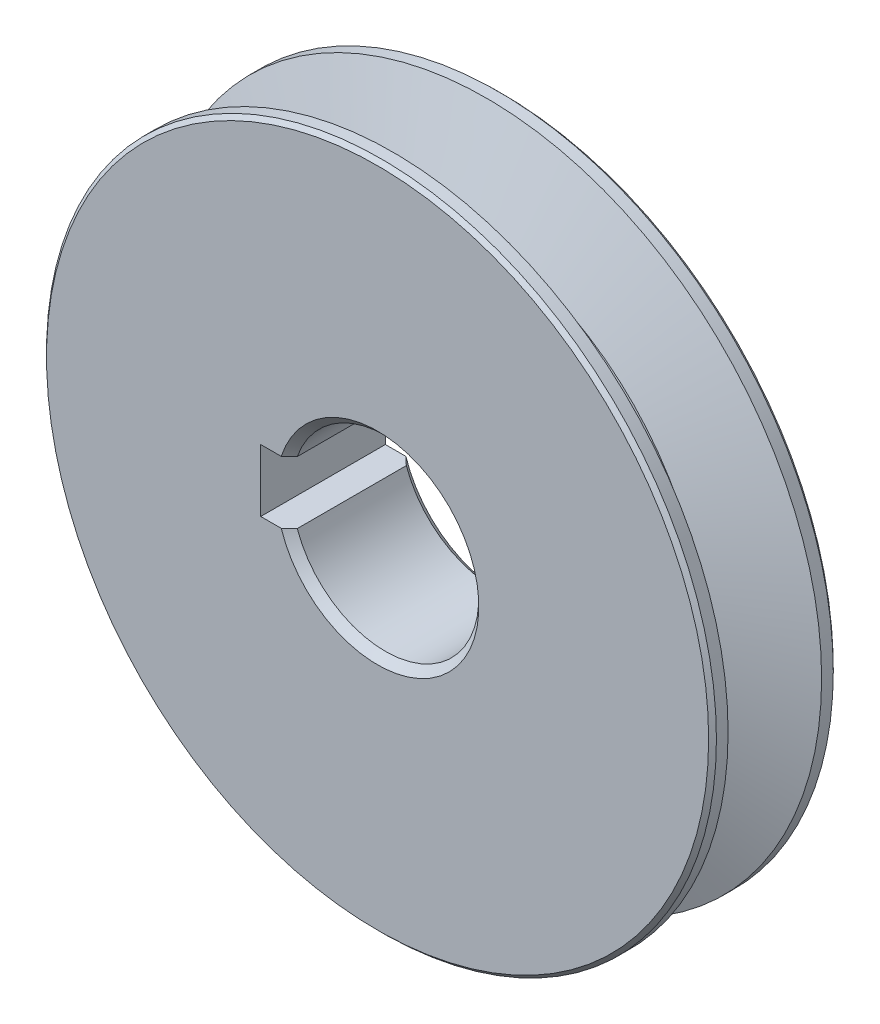
ISO-10303-21;
HEADER;
FILE_DESCRIPTION(('STEP AP214'),'2;1');
FILE_NAME('part.step','',(''),(''),'','','');
FILE_SCHEMA(('AUTOMOTIVE_DESIGN { 1 0 10303 214 1 1 1 1 }'));
ENDSEC;
DATA;
#1=APPLICATION_CONTEXT('core data for automotive mechanical design processes');
#2=APPLICATION_PROTOCOL_DEFINITION('international standard','automotive_design',2000,#1);
#3=PRODUCT_CONTEXT('',#1,'mechanical');
#4=PRODUCT('Part','Part','',(#3));
#5=PRODUCT_RELATED_PRODUCT_CATEGORY('part','',(#4));
#6=PRODUCT_DEFINITION_FORMATION('','',#4);
#7=PRODUCT_DEFINITION_CONTEXT('part definition',#1,'design');
#8=PRODUCT_DEFINITION('design','',#6,#7);
#9=PRODUCT_DEFINITION_SHAPE('','',#8);
#10=(LENGTH_UNIT() NAMED_UNIT(*) SI_UNIT(.MILLI.,.METRE.));
#11=(NAMED_UNIT(*) PLANE_ANGLE_UNIT() SI_UNIT($,.RADIAN.));
#12=(NAMED_UNIT(*) SI_UNIT($,.STERADIAN.) SOLID_ANGLE_UNIT());
#13=UNCERTAINTY_MEASURE_WITH_UNIT(LENGTH_MEASURE(1.E-05),#10,'distance_accuracy_value','');
#14=(GEOMETRIC_REPRESENTATION_CONTEXT(3) GLOBAL_UNCERTAINTY_ASSIGNED_CONTEXT((#13)) GLOBAL_UNIT_ASSIGNED_CONTEXT((#10,
#11,#12)) REPRESENTATION_CONTEXT('',''));
#15=CARTESIAN_POINT('',(0.,0.,0.));
#16=DIRECTION('',(0.,0.,1.));
#17=DIRECTION('',(1.,0.,0.));
#18=AXIS2_PLACEMENT_3D('',#15,#16,#17);
#19=CARTESIAN_POINT('',(0.02123051128702,9.01009597848504E-13,-5.99999999999978));
#20=DIRECTION('',(0.,0.,1.));
#21=DIRECTION('',(1.,0.,0.));
#22=AXIS2_PLACEMENT_3D('',#19,#20,#21);
#23=CYLINDRICAL_SURFACE('',#22,32.25);
#24=CARTESIAN_POINT('',(0.0212305112870201,9.01009597848504E-13,-5.62499999999969));
#25=DIRECTION('',(0.,0.,-1.));
#26=DIRECTION('',(-1.,0.,0.));
#27=AXIS2_PLACEMENT_3D('',#24,#25,#26);
#28=CIRCLE('',#27,32.25);
#29=CARTESIAN_POINT('',(-32.228769488713,9.01009597848504E-13,-5.62499999999969));
#30=VERTEX_POINT('',#29);
#31=EDGE_CURVE('E42',#30,#30,#28,.F.);
#32=ORIENTED_EDGE('',*,*,#31,.T.);
#33=EDGE_LOOP('',(#32));
#34=FACE_BOUND('',#33,.T.);
#35=CARTESIAN_POINT('',(0.0212305112870202,9.01009597848504E-13,-4.50275443269578));
#36=DIRECTION('',(0.,0.,1.));
#37=DIRECTION('',(1.,0.,0.));
#38=AXIS2_PLACEMENT_3D('',#35,#36,#37);
#39=CIRCLE('',#38,32.25);
#40=CARTESIAN_POINT('',(32.271230511287,9.01009597848504E-13,-4.50275443269578));
#41=VERTEX_POINT('',#40);
#42=EDGE_CURVE('E120',#41,#41,#39,.T.);
#43=ORIENTED_EDGE('',*,*,#42,.F.);
#44=EDGE_LOOP('',(#43));
#45=FACE_BOUND('',#44,.T.);
#46=ADVANCED_FACE('F34',(#34,#45),#23,.T.);
#47=CARTESIAN_POINT('',(32.271230511287,9.01009597848504E-13,-5.99999999999979));
#48=DIRECTION('',(0.,0.,-1.));
#49=DIRECTION('',(-1.,0.,0.));
#50=AXIS2_PLACEMENT_3D('',#47,#48,#49);
#51=PLANE('',#50);
#52=CARTESIAN_POINT('',(0.02123051128702,9.01009597848504E-13,-5.99999999999978));
#53=DIRECTION('',(0.,0.,-1.));
#54=DIRECTION('',(-1.,0.,0.));
#55=AXIS2_PLACEMENT_3D('',#52,#53,#54);
#56=CIRCLE('',#55,31.875);
#57=CARTESIAN_POINT('',(-31.853769488713,9.01009597848504E-13,-5.99999999999978));
#58=VERTEX_POINT('',#57);
#59=EDGE_CURVE('E11',#58,#58,#56,.T.);
#60=ORIENTED_EDGE('',*,*,#59,.T.);
#61=EDGE_LOOP('',(#60));
#62=FACE_BOUND('',#61,.T.);
#63=DIRECTION('',(1.,0.,0.));
#64=VECTOR('',#63,1.);
#65=CARTESIAN_POINT('',(-11.2287694887134,-2.9999999999991,-5.99999999999978));
#66=LINE('',#65,#64);
#67=CARTESIAN_POINT('',(-11.2287694887134,-2.9999999999991,-5.99999999999978));
#68=VERTEX_POINT('',#67);
#69=CARTESIAN_POINT('',(-9.25575716274696,-2.9999999999991,-5.99999999999978));
#70=VERTEX_POINT('',#69);
#71=EDGE_CURVE('E101',#68,#70,#66,.T.);
#72=ORIENTED_EDGE('',*,*,#71,.T.);
#73=CARTESIAN_POINT('',(0.0212305112866469,9.01009597848504E-13,-5.99999999999978));
#74=DIRECTION('',(0.,0.,-1.));
#75=DIRECTION('',(-1.,0.,0.));
#76=AXIS2_PLACEMENT_3D('',#73,#74,#75);
#77=CIRCLE('',#76,9.75000001559854);
#78=CARTESIAN_POINT('',(-9.25575716298804,2.9999999992554,-5.99999999999978));
#79=VERTEX_POINT('',#78);
#80=EDGE_CURVE('E184',#70,#79,#77,.F.);
#81=ORIENTED_EDGE('',*,*,#80,.T.);
#82=DIRECTION('',(-1.,0.,0.));
#83=VECTOR('',#82,1.);
#84=CARTESIAN_POINT('',(-8.4640508632155,2.9999999992554,-5.99999999999978));
#85=LINE('',#84,#83);
#86=CARTESIAN_POINT('',(-11.2287694887134,2.9999999992554,-5.99999999999978));
#87=VERTEX_POINT('',#86);
#88=EDGE_CURVE('E99',#79,#87,#85,.T.);
#89=ORIENTED_EDGE('',*,*,#88,.T.);
#90=DIRECTION('',(0.,-1.,0.));
#91=VECTOR('',#90,1.);
#92=CARTESIAN_POINT('',(-11.2287694887134,2.9999999992554,-5.99999999999978));
#93=LINE('',#92,#91);
#94=EDGE_CURVE('E95',#87,#68,#93,.T.);
#95=ORIENTED_EDGE('',*,*,#94,.T.);
#96=EDGE_LOOP('',(#72,#81,#89,#95));
#97=FACE_BOUND('',#96,.T.);
#98=ADVANCED_FACE('F107',(#62,#97),#51,.T.);
#99=CARTESIAN_POINT('',(0.0212305112870215,9.01009597848504E-13,6.00000000000022));
#100=DIRECTION('',(0.,0.,1.));
#101=DIRECTION('',(1.,0.,0.));
#102=AXIS2_PLACEMENT_3D('',#99,#100,#101);
#103=PLANE('',#102);
#104=CARTESIAN_POINT('',(0.0212305112870215,9.01009597848504E-13,6.00000000000022));
#105=DIRECTION('',(0.,0.,1.));
#106=DIRECTION('',(1.,0.,0.));
#107=AXIS2_PLACEMENT_3D('',#104,#105,#106);
#108=CIRCLE('',#107,31.8749999999999);
#109=CARTESIAN_POINT('',(31.8962305112869,9.01009597848504E-13,6.00000000000022));
#110=VERTEX_POINT('',#109);
#111=EDGE_CURVE('E331',#110,#110,#108,.T.);
#112=ORIENTED_EDGE('',*,*,#111,.T.);
#113=EDGE_LOOP('',(#112));
#114=FACE_BOUND('',#113,.T.);
#115=DIRECTION('',(-1.,0.,0.));
#116=VECTOR('',#115,1.);
#117=CARTESIAN_POINT('',(-8.4640508632155,2.9999999992554,6.00000000000022));
#118=LINE('',#117,#116);
#119=CARTESIAN_POINT('',(-9.2557571609674,2.9999999992554,6.00000000000022));
#120=VERTEX_POINT('',#119);
#121=CARTESIAN_POINT('',(-11.2287694887134,2.9999999992554,6.00000000000022));
#122=VERTEX_POINT('',#121);
#123=EDGE_CURVE('E110',#120,#122,#118,.T.);
#124=ORIENTED_EDGE('',*,*,#123,.F.);
#125=CARTESIAN_POINT('',(0.0212305112866469,9.01009597848504E-13,6.00000000000022));
#126=DIRECTION('',(0.,0.,1.));
#127=DIRECTION('',(1.,0.,0.));
#128=AXIS2_PLACEMENT_3D('',#125,#126,#127);
#129=CIRCLE('',#128,9.75000001367592);
#130=CARTESIAN_POINT('',(-9.25575716072631,-2.9999999999991,6.00000000000022));
#131=VERTEX_POINT('',#130);
#132=EDGE_CURVE('E57',#120,#131,#129,.F.);
#133=ORIENTED_EDGE('',*,*,#132,.T.);
#134=DIRECTION('',(1.,0.,0.));
#135=VECTOR('',#134,1.);
#136=CARTESIAN_POINT('',(-11.2287694887134,-2.9999999999991,6.00000000000022));
#137=LINE('',#136,#135);
#138=CARTESIAN_POINT('',(-11.2287694887134,-2.9999999999991,6.00000000000022));
#139=VERTEX_POINT('',#138);
#140=EDGE_CURVE('E112',#139,#131,#137,.T.);
#141=ORIENTED_EDGE('',*,*,#140,.F.);
#142=DIRECTION('',(0.,-1.,0.));
#143=VECTOR('',#142,1.);
#144=CARTESIAN_POINT('',(-11.2287694887134,2.9999999992554,6.00000000000022));
#145=LINE('',#144,#143);
#146=EDGE_CURVE('E97',#122,#139,#145,.T.);
#147=ORIENTED_EDGE('',*,*,#146,.F.);
#148=EDGE_LOOP('',(#124,#133,#141,#147));
#149=FACE_BOUND('',#148,.T.);
#150=ADVANCED_FACE('F197',(#114,#149),#103,.T.);
#151=CARTESIAN_POINT('',(0.02123051128702,9.01009597848504E-13,-5.99999999999978));
#152=DIRECTION('',(0.,0.,1.));
#153=DIRECTION('',(1.,0.,0.));
#154=AXIS2_PLACEMENT_3D('',#151,#152,#153);
#155=CYLINDRICAL_SURFACE('',#154,32.25);
#156=CARTESIAN_POINT('',(0.0212305112870214,9.01009597848504E-13,5.62500000000025));
#157=DIRECTION('',(0.,0.,1.));
#158=DIRECTION('',(1.,0.,0.));
#159=AXIS2_PLACEMENT_3D('',#156,#157,#158);
#160=CIRCLE('',#159,32.25);
#161=CARTESIAN_POINT('',(32.271230511287,9.01009597848504E-13,5.62500000000025));
#162=VERTEX_POINT('',#161);
#163=EDGE_CURVE('E329',#162,#162,#160,.F.);
#164=ORIENTED_EDGE('',*,*,#163,.T.);
#165=EDGE_LOOP('',(#164));
#166=FACE_BOUND('',#165,.T.);
#167=CARTESIAN_POINT('',(0.0212305112870213,9.01009597848504E-13,4.50275443269622));
#168=DIRECTION('',(0.,0.,1.));
#169=DIRECTION('',(1.,0.,0.));
#170=AXIS2_PLACEMENT_3D('',#167,#168,#169);
#171=CIRCLE('',#170,32.25);
#172=CARTESIAN_POINT('',(32.271230511287,9.01009597848504E-13,4.50275443269622));
#173=VERTEX_POINT('',#172);
#174=EDGE_CURVE('E134',#173,#173,#171,.T.);
#175=ORIENTED_EDGE('',*,*,#174,.T.);
#176=EDGE_LOOP('',(#175));
#177=FACE_BOUND('',#176,.T.);
#178=ADVANCED_FACE('F201',(#166,#177),#155,.T.);
#179=CARTESIAN_POINT('',(0.0212305112870213,9.01009597848504E-13,4.50275443269622));
#180=DIRECTION('',(0.,0.,1.));
#181=DIRECTION('',(1.,0.,0.));
#182=AXIS2_PLACEMENT_3D('',#179,#180,#181);
#183=CONICAL_SURFACE('',#182,32.25,1.22173047639594);
#184=CARTESIAN_POINT('',(0.0212305112870209,9.01009597848504E-13,1.4999999999992));
#185=DIRECTION('',(0.,0.,1.));
#186=DIRECTION('',(1.,0.,0.));
#187=AXIS2_PLACEMENT_3D('',#184,#185,#186);
#188=CIRCLE('',#187,24.);
#189=CARTESIAN_POINT('',(24.021230511287,9.01009597848504E-13,1.49999999999919));
#190=VERTEX_POINT('',#189);
#191=EDGE_CURVE('E131',#190,#190,#188,.T.);
#192=ORIENTED_EDGE('',*,*,#191,.T.);
#193=EDGE_LOOP('',(#192));
#194=FACE_BOUND('',#193,.T.);
#195=ORIENTED_EDGE('',*,*,#174,.F.);
#196=EDGE_LOOP('',(#195));
#197=FACE_BOUND('',#196,.T.);
#198=ADVANCED_FACE('F205',(#194,#197),#183,.T.);
#199=CARTESIAN_POINT('',(0.02123051128702,9.01009597848504E-13,-5.99999999999978));
#200=DIRECTION('',(0.,0.,1.));
#201=DIRECTION('',(1.,0.,0.));
#202=AXIS2_PLACEMENT_3D('',#199,#200,#201);
#203=CYLINDRICAL_SURFACE('',#202,24.);
#204=CARTESIAN_POINT('',(0.0212305112870206,9.01009597848504E-13,-1.49999999999978));
#205=DIRECTION('',(0.,0.,1.));
#206=DIRECTION('',(1.,0.,0.));
#207=AXIS2_PLACEMENT_3D('',#204,#205,#206);
#208=CIRCLE('',#207,24.);
#209=CARTESIAN_POINT('',(24.021230511287,9.01009597848504E-13,-1.49999999999978));
#210=VERTEX_POINT('',#209);
#211=EDGE_CURVE('E128',#210,#210,#208,.T.);
#212=ORIENTED_EDGE('',*,*,#211,.T.);
#213=EDGE_LOOP('',(#212));
#214=FACE_BOUND('',#213,.T.);
#215=ORIENTED_EDGE('',*,*,#191,.F.);
#216=EDGE_LOOP('',(#215));
#217=FACE_BOUND('',#216,.T.);
#218=ADVANCED_FACE('F209',(#214,#217),#203,.T.);
#219=CARTESIAN_POINT('',(0.0212305112870206,9.01009597848504E-13,-1.49999999999978));
#220=DIRECTION('',(0.,0.,-1.));
#221=DIRECTION('',(-1.,0.,0.));
#222=AXIS2_PLACEMENT_3D('',#219,#220,#221);
#223=CONICAL_SURFACE('',#222,24.,1.22173047639605);
#224=ORIENTED_EDGE('',*,*,#42,.T.);
#225=EDGE_LOOP('',(#224));
#226=FACE_BOUND('',#225,.T.);
#227=ORIENTED_EDGE('',*,*,#211,.F.);
#228=EDGE_LOOP('',(#227));
#229=FACE_BOUND('',#228,.T.);
#230=ADVANCED_FACE('F212',(#226,#229),#223,.T.);
#231=CARTESIAN_POINT('',(-11.2287694887134,2.9999999992554,-5.99999999999978));
#232=DIRECTION('',(-1.,0.,0.));
#233=DIRECTION('',(0.,0.,1.));
#234=AXIS2_PLACEMENT_3D('',#231,#232,#233);
#235=PLANE('',#234);
#236=ORIENTED_EDGE('',*,*,#146,.T.);
#237=DIRECTION('',(0.,0.,1.));
#238=VECTOR('',#237,1.);
#239=CARTESIAN_POINT('',(-11.2287694887134,-2.9999999999991,-5.99999999999978));
#240=LINE('',#239,#238);
#241=EDGE_CURVE('E91',#68,#139,#240,.T.);
#242=ORIENTED_EDGE('',*,*,#241,.F.);
#243=ORIENTED_EDGE('',*,*,#94,.F.);
#244=DIRECTION('',(0.,0.,1.));
#245=VECTOR('',#244,1.);
#246=CARTESIAN_POINT('',(-11.2287694887134,2.9999999992554,-5.99999999999978));
#247=LINE('',#246,#245);
#248=EDGE_CURVE('E118',#87,#122,#247,.T.);
#249=ORIENTED_EDGE('',*,*,#248,.T.);
#250=EDGE_LOOP('',(#236,#242,#243,#249));
#251=FACE_BOUND('',#250,.T.);
#252=ADVANCED_FACE('F92',(#251),#235,.F.);
#253=CARTESIAN_POINT('',(-8.4640508632155,2.9999999992554,-5.99999999999978));
#254=DIRECTION('',(0.,1.,0.));
#255=DIRECTION('',(0.,0.,1.));
#256=AXIS2_PLACEMENT_3D('',#253,#254,#255);
#257=PLANE('',#256);
#258=DIRECTION('',(0.,0.,1.));
#259=VECTOR('',#258,1.);
#260=CARTESIAN_POINT('',(-8.46405086321549,2.9999999992554,-5.99999999999978));
#261=LINE('',#260,#259);
#262=CARTESIAN_POINT('',(-8.46405086321549,2.9999999992554,-5.24999998632386));
#263=VERTEX_POINT('',#262);
#264=CARTESIAN_POINT('',(-8.46405086321549,2.9999999992554,5.24999998440168));
#265=VERTEX_POINT('',#264);
#266=EDGE_CURVE('E121',#263,#265,#261,.T.);
#267=ORIENTED_EDGE('',*,*,#266,.T.);
#268=CARTESIAN_POINT('',(-8.4640508632155,2.9999999992554,5.24999998440168));
#269=CARTESIAN_POINT('',(-8.59628727510804,2.9999999992554,5.37469876997658));
#270=CARTESIAN_POINT('',(-8.72838100929807,2.9999999992554,5.49954816732916));
#271=CARTESIAN_POINT('',(-8.99228310851896,2.9999999992554,5.74954817256007));
#272=CARTESIAN_POINT('',(-9.12409147357956,2.9999999992554,5.874698780407));
#273=CARTESIAN_POINT('',(-9.2557571609674,2.9999999992554,6.00000000000022));
#274=B_SPLINE_CURVE_WITH_KNOTS('',3,(#268,#269,#270,#271,#272,#273),.UNSPECIFIED.,.F.,.F.,(4,2,
4),(0.,0.545275287982242,1.09055051912671),.UNSPECIFIED.);
#275=EDGE_CURVE('E150',#265,#120,#274,.T.);
#276=ORIENTED_EDGE('',*,*,#275,.T.);
#277=ORIENTED_EDGE('',*,*,#123,.T.);
#278=ORIENTED_EDGE('',*,*,#248,.F.);
#279=ORIENTED_EDGE('',*,*,#88,.F.);
#280=CARTESIAN_POINT('',(-9.25575716298804,2.9999999992554,-5.99999999999978));
#281=CARTESIAN_POINT('',(-9.12409147526326,2.9999999992554,-5.87469878072564));
#282=CARTESIAN_POINT('',(-8.9922831098658,2.9999999992554,-5.74954817319845));
#283=CARTESIAN_POINT('',(-8.72838100997136,2.9999999992554,-5.49954816860841));
#284=CARTESIAN_POINT('',(-8.59628727544464,2.9999999992554,-5.37469877157695));
#285=CARTESIAN_POINT('',(-8.4640508632155,2.9999999992554,-5.24999998632386));
#286=B_SPLINE_CURVE_WITH_KNOTS('',3,(#280,#281,#282,#283,#284,#285),.UNSPECIFIED.,.F.,.F.,(4,2,
4),(0.,0.545275231216821,1.09055051927141),.UNSPECIFIED.);
#287=EDGE_CURVE('E142',#79,#263,#286,.T.);
#288=ORIENTED_EDGE('',*,*,#287,.T.);
#289=EDGE_LOOP('',(#267,#276,#277,#278,#279,#288));
#290=FACE_BOUND('',#289,.T.);
#291=ADVANCED_FACE('F159',(#290),#257,.F.);
#292=CARTESIAN_POINT('',(-11.2287694887134,-2.9999999999991,-5.99999999999978));
#293=DIRECTION('',(0.,-1.,0.));
#294=DIRECTION('',(0.,0.,-1.));
#295=AXIS2_PLACEMENT_3D('',#292,#293,#294);
#296=PLANE('',#295);
#297=ORIENTED_EDGE('',*,*,#140,.T.);
#298=CARTESIAN_POINT('',(-9.25575716072631,-2.9999999999991,6.00000000000022));
#299=CARTESIAN_POINT('',(-9.12409147333489,-2.9999999999991,5.87469878040683));
#300=CARTESIAN_POINT('',(-8.99228310827062,-2.9999999999991,5.7495481725598));
#301=CARTESIAN_POINT('',(-8.72838100904223,-2.9999999999991,5.49954816732889));
#302=CARTESIAN_POINT('',(-8.59628727484837,-2.9999999999991,5.3746987699764));
#303=CARTESIAN_POINT('',(-8.46405086295192,-2.9999999999991,5.24999998440168));
#304=B_SPLINE_CURVE_WITH_KNOTS('',3,(#298,#299,#300,#301,#302,#303),.UNSPECIFIED.,.F.,.F.,(4,2,
4),(0.,0.545275231152638,1.09055051914304),.UNSPECIFIED.);
#305=CARTESIAN_POINT('',(-8.46405086295192,-2.9999999999991,5.24999998440168));
#306=VERTEX_POINT('',#305);
#307=EDGE_CURVE('E178',#131,#306,#304,.T.);
#308=ORIENTED_EDGE('',*,*,#307,.T.);
#309=DIRECTION('',(0.,0.,1.));
#310=VECTOR('',#309,1.);
#311=CARTESIAN_POINT('',(-8.46405086295192,-2.9999999999991,-5.99999999999978));
#312=LINE('',#311,#310);
#313=CARTESIAN_POINT('',(-8.46405086295192,-2.9999999999991,-5.24999998632386));
#314=VERTEX_POINT('',#313);
#315=EDGE_CURVE('E98',#314,#306,#312,.T.);
#316=ORIENTED_EDGE('',*,*,#315,.F.);
#317=CARTESIAN_POINT('',(-8.46405086295192,-2.9999999999991,-5.24999998632386));
#318=CARTESIAN_POINT('',(-8.59628727518497,-2.9999999999991,-5.37469877157678));
#319=CARTESIAN_POINT('',(-8.72838100971552,-2.9999999999991,-5.49954816860815));
#320=CARTESIAN_POINT('',(-8.99228310961746,-2.9999999999991,-5.74954817319819));
#321=CARTESIAN_POINT('',(-9.12409147501859,-2.9999999999991,-5.87469878072546));
#322=CARTESIAN_POINT('',(-9.25575716274696,-2.9999999999991,-5.99999999999978));
#323=B_SPLINE_CURVE_WITH_KNOTS('',3,(#317,#318,#319,#320,#321,#322),.UNSPECIFIED.,.F.,.F.,(4,2,
4),(0.,0.545275288062756,1.09055051928774),.UNSPECIFIED.);
#324=EDGE_CURVE('E49',#314,#70,#323,.T.);
#325=ORIENTED_EDGE('',*,*,#324,.T.);
#326=ORIENTED_EDGE('',*,*,#71,.F.);
#327=ORIENTED_EDGE('',*,*,#241,.T.);
#328=EDGE_LOOP('',(#297,#308,#316,#325,#326,#327));
#329=FACE_BOUND('',#328,.T.);
#330=ADVANCED_FACE('F102',(#329),#296,.F.);
#331=CARTESIAN_POINT('',(0.0212305112866469,9.01009597848504E-13,-5.99999999999978));
#332=DIRECTION('',(0.,0.,1.));
#333=DIRECTION('',(1.,0.,0.));
#334=AXIS2_PLACEMENT_3D('',#331,#332,#333);
#335=CYLINDRICAL_SURFACE('',#334,9.);
#336=ORIENTED_EDGE('',*,*,#315,.T.);
#337=CARTESIAN_POINT('',(0.0212305112866469,9.01009597848504E-13,5.24999998440168));
#338=DIRECTION('',(0.,0.,1.));
#339=DIRECTION('',(1.,0.,0.));
#340=AXIS2_PLACEMENT_3D('',#337,#338,#339);
#341=CIRCLE('',#340,9.);
#342=EDGE_CURVE('E139',#306,#265,#341,.T.);
#343=ORIENTED_EDGE('',*,*,#342,.T.);
#344=ORIENTED_EDGE('',*,*,#266,.F.);
#345=CARTESIAN_POINT('',(0.0212305112866469,9.01009597848504E-13,-5.24999998632386));
#346=DIRECTION('',(0.,0.,-1.));
#347=DIRECTION('',(-1.,0.,0.));
#348=AXIS2_PLACEMENT_3D('',#345,#346,#347);
#349=CIRCLE('',#348,9.);
#350=EDGE_CURVE('E137',#263,#314,#349,.T.);
#351=ORIENTED_EDGE('',*,*,#350,.T.);
#352=EDGE_LOOP('',(#336,#343,#344,#351));
#353=FACE_BOUND('',#352,.T.);
#354=ADVANCED_FACE('F165',(#353),#335,.F.);
#355=CARTESIAN_POINT('',(0.0212305112866469,9.01009597848504E-13,5.24999998440168));
#356=DIRECTION('',(0.,0.,1.));
#357=DIRECTION('',(1.,0.,0.));
#358=AXIS2_PLACEMENT_3D('',#355,#356,#357);
#359=CONICAL_SURFACE('',#358,9.,0.785398162115705);
#360=ORIENTED_EDGE('',*,*,#307,.F.);
#361=ORIENTED_EDGE('',*,*,#132,.F.);
#362=ORIENTED_EDGE('',*,*,#275,.F.);
#363=ORIENTED_EDGE('',*,*,#342,.F.);
#364=EDGE_LOOP('',(#360,#361,#362,#363));
#365=FACE_BOUND('',#364,.T.);
#366=ADVANCED_FACE('F186',(#365),#359,.F.);
#367=CARTESIAN_POINT('',(0.0212305112866469,9.01009597848504E-13,-5.99999999999978));
#368=DIRECTION('',(0.,0.,-1.));
#369=DIRECTION('',(-1.,0.,0.));
#370=AXIS2_PLACEMENT_3D('',#367,#368,#369);
#371=CONICAL_SURFACE('',#370,9.75000001559854,0.785398164679191);
#372=ORIENTED_EDGE('',*,*,#324,.F.);
#373=ORIENTED_EDGE('',*,*,#350,.F.);
#374=ORIENTED_EDGE('',*,*,#287,.F.);
#375=ORIENTED_EDGE('',*,*,#80,.F.);
#376=EDGE_LOOP('',(#372,#373,#374,#375));
#377=FACE_BOUND('',#376,.T.);
#378=ADVANCED_FACE('F157',(#377),#371,.F.);
#379=CARTESIAN_POINT('',(0.0212305112870215,9.01009597848504E-13,6.00000000000022));
#380=DIRECTION('',(0.,0.,-1.));
#381=DIRECTION('',(-1.,0.,0.));
#382=AXIS2_PLACEMENT_3D('',#379,#380,#381);
#383=CONICAL_SURFACE('',#382,31.8749999999999,0.785398163397601);
#384=ORIENTED_EDGE('',*,*,#163,.F.);
#385=EDGE_LOOP('',(#384));
#386=FACE_BOUND('',#385,.T.);
#387=ORIENTED_EDGE('',*,*,#111,.F.);
#388=EDGE_LOOP('',(#387));
#389=FACE_BOUND('',#388,.T.);
#390=ADVANCED_FACE('F254',(#386,#389),#383,.T.);
#391=CARTESIAN_POINT('',(0.0212305112870201,9.01009597848504E-13,-5.62499999999969));
#392=DIRECTION('',(0.,0.,1.));
#393=DIRECTION('',(1.,0.,0.));
#394=AXIS2_PLACEMENT_3D('',#391,#392,#393);
#395=CONICAL_SURFACE('',#394,32.25,0.785398163397303);
#396=ORIENTED_EDGE('',*,*,#59,.F.);
#397=EDGE_LOOP('',(#396));
#398=FACE_BOUND('',#397,.T.);
#399=ORIENTED_EDGE('',*,*,#31,.F.);
#400=EDGE_LOOP('',(#399));
#401=FACE_BOUND('',#400,.T.);
#402=ADVANCED_FACE('F36',(#398,#401),#395,.T.);
#403=CLOSED_SHELL('',(#46,#98,#150,#178,#198,#218,#230,#252,#291,#330,#354,#366,#378,#390,#402));
#404=MANIFOLD_SOLID_BREP('B2',#403);
#405=ADVANCED_BREP_SHAPE_REPRESENTATION('',(#18,#404),#14);
#406=SHAPE_DEFINITION_REPRESENTATION(#9,#405);
ENDSEC;
END-ISO-10303-21;
